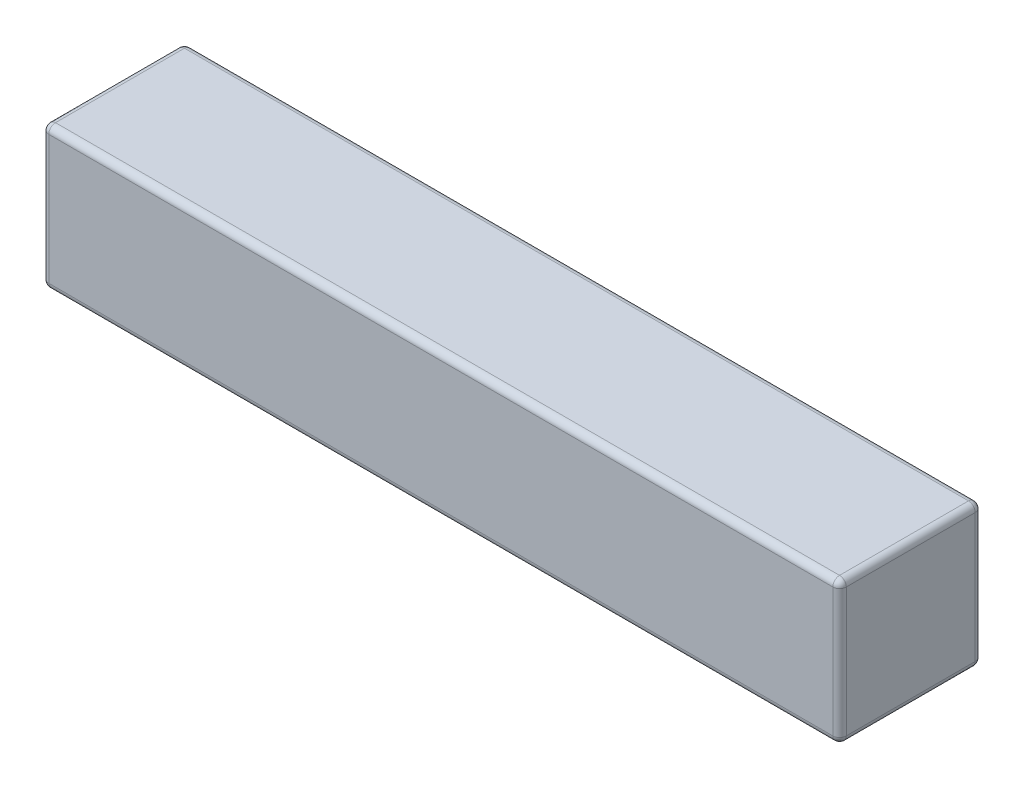
ISO-10303-21;
HEADER;
FILE_DESCRIPTION(('STEP AP214'),'2;1');
FILE_NAME('part.step','',(''),(''),'','','');
FILE_SCHEMA(('AUTOMOTIVE_DESIGN { 1 0 10303 214 1 1 1 1 }'));
ENDSEC;
DATA;
#1=APPLICATION_CONTEXT('core data for automotive mechanical design processes');
#2=APPLICATION_PROTOCOL_DEFINITION('international standard','automotive_design',2000,#1);
#3=PRODUCT_CONTEXT('',#1,'mechanical');
#4=PRODUCT('Part','Part','',(#3));
#5=PRODUCT_RELATED_PRODUCT_CATEGORY('part','',(#4));
#6=PRODUCT_DEFINITION_FORMATION('','',#4);
#7=PRODUCT_DEFINITION_CONTEXT('part definition',#1,'design');
#8=PRODUCT_DEFINITION('design','',#6,#7);
#9=PRODUCT_DEFINITION_SHAPE('','',#8);
#10=(LENGTH_UNIT() NAMED_UNIT(*) SI_UNIT(.MILLI.,.METRE.));
#11=(NAMED_UNIT(*) PLANE_ANGLE_UNIT() SI_UNIT($,.RADIAN.));
#12=(NAMED_UNIT(*) SI_UNIT($,.STERADIAN.) SOLID_ANGLE_UNIT());
#13=UNCERTAINTY_MEASURE_WITH_UNIT(LENGTH_MEASURE(1.E-05),#10,'distance_accuracy_value','');
#14=(GEOMETRIC_REPRESENTATION_CONTEXT(3) GLOBAL_UNCERTAINTY_ASSIGNED_CONTEXT((#13)) GLOBAL_UNIT_ASSIGNED_CONTEXT((#10,
#11,#12)) REPRESENTATION_CONTEXT('',''));
#15=CARTESIAN_POINT('',(0.,0.,0.));
#16=DIRECTION('',(0.,0.,1.));
#17=DIRECTION('',(1.,0.,0.));
#18=AXIS2_PLACEMENT_3D('',#15,#16,#17);
#19=CARTESIAN_POINT('',(13.85,-0.15,-0.379239631336402));
#20=DIRECTION('',(1.,0.,0.));
#21=DIRECTION('',(0.,0.,-1.));
#22=AXIS2_PLACEMENT_3D('',#19,#20,#21);
#23=SPHERICAL_SURFACE('',#22,0.15);
#24=CARTESIAN_POINT('',(13.85,-0.15,-0.379239631336402));
#25=DIRECTION('',(0.,1.,0.));
#26=DIRECTION('',(0.,0.,1.));
#27=AXIS2_PLACEMENT_3D('',#24,#25,#26);
#28=CIRCLE('',#27,0.15);
#29=CARTESIAN_POINT('',(14.,-0.15,-0.379239631336402));
#30=VERTEX_POINT('',#29);
#31=CARTESIAN_POINT('',(13.85,-0.15,-0.229239631336402));
#32=VERTEX_POINT('',#31);
#33=EDGE_CURVE('E293',#30,#32,#28,.F.);
#34=ORIENTED_EDGE('',*,*,#33,.F.);
#35=CARTESIAN_POINT('',(13.85,-0.15,-0.379239631336402));
#36=DIRECTION('',(0.,0.,-1.));
#37=DIRECTION('',(-1.,0.,0.));
#38=AXIS2_PLACEMENT_3D('',#35,#36,#37);
#39=CIRCLE('',#38,0.150000000000001);
#40=CARTESIAN_POINT('',(13.85,0.,-0.379239631336402));
#41=VERTEX_POINT('',#40);
#42=EDGE_CURVE('E115',#41,#30,#39,.T.);
#43=ORIENTED_EDGE('',*,*,#42,.F.);
#44=CARTESIAN_POINT('',(13.85,-0.15,-0.379239631336402));
#45=DIRECTION('',(1.,0.,0.));
#46=DIRECTION('',(0.,0.,-1.));
#47=AXIS2_PLACEMENT_3D('',#44,#45,#46);
#48=CIRCLE('',#47,0.15);
#49=EDGE_CURVE('E104',#32,#41,#48,.F.);
#50=ORIENTED_EDGE('',*,*,#49,.F.);
#51=EDGE_LOOP('',(#34,#43,#50));
#52=FACE_BOUND('',#51,.T.);
#53=ADVANCED_FACE('F17',(#52),#23,.T.);
#54=CARTESIAN_POINT('',(13.85,-0.15,-3.2542396313364));
#55=DIRECTION('',(1.,0.,0.));
#56=DIRECTION('',(0.,0.,-1.));
#57=AXIS2_PLACEMENT_3D('',#54,#55,#56);
#58=SPHERICAL_SURFACE('',#57,0.15);
#59=CARTESIAN_POINT('',(13.85,-0.15,-3.2542396313364));
#60=DIRECTION('',(0.,1.,0.));
#61=DIRECTION('',(0.,0.,1.));
#62=AXIS2_PLACEMENT_3D('',#59,#60,#61);
#63=CIRCLE('',#62,0.15);
#64=CARTESIAN_POINT('',(13.85,-0.15,-3.4042396313364));
#65=VERTEX_POINT('',#64);
#66=CARTESIAN_POINT('',(14.,-0.15,-3.2542396313364));
#67=VERTEX_POINT('',#66);
#68=EDGE_CURVE('E136',#65,#67,#63,.F.);
#69=ORIENTED_EDGE('',*,*,#68,.F.);
#70=CARTESIAN_POINT('',(13.85,-0.15,-3.2542396313364));
#71=DIRECTION('',(-1.,0.,0.));
#72=DIRECTION('',(0.,0.,1.));
#73=AXIS2_PLACEMENT_3D('',#70,#71,#72);
#74=CIRCLE('',#73,0.15);
#75=CARTESIAN_POINT('',(13.85,0.,-3.2542396313364));
#76=VERTEX_POINT('',#75);
#77=EDGE_CURVE('E288',#76,#65,#74,.T.);
#78=ORIENTED_EDGE('',*,*,#77,.F.);
#79=CARTESIAN_POINT('',(13.85,-0.15,-3.2542396313364));
#80=DIRECTION('',(0.,0.,-1.));
#81=DIRECTION('',(-1.,0.,0.));
#82=AXIS2_PLACEMENT_3D('',#79,#80,#81);
#83=CIRCLE('',#82,0.150000000000001);
#84=EDGE_CURVE('E284',#67,#76,#83,.F.);
#85=ORIENTED_EDGE('',*,*,#84,.F.);
#86=EDGE_LOOP('',(#69,#78,#85));
#87=FACE_BOUND('',#86,.T.);
#88=ADVANCED_FACE('F157',(#87),#58,.T.);
#89=CARTESIAN_POINT('',(-3.78,0.,-0.229239631336402));
#90=DIRECTION('',(0.,1.,0.));
#91=DIRECTION('',(0.,0.,1.));
#92=AXIS2_PLACEMENT_3D('',#89,#90,#91);
#93=PLANE('',#92);
#94=DIRECTION('',(0.,0.,1.));
#95=VECTOR('',#94,1.);
#96=CARTESIAN_POINT('',(-3.63,0.,-0.229239631336402));
#97=LINE('',#96,#95);
#98=CARTESIAN_POINT('',(-3.63,0.,-0.379239631336402));
#99=VERTEX_POINT('',#98);
#100=CARTESIAN_POINT('',(-3.63,0.,-3.2542396313364));
#101=VERTEX_POINT('',#100);
#102=EDGE_CURVE('E119',#99,#101,#97,.F.);
#103=ORIENTED_EDGE('',*,*,#102,.F.);
#104=DIRECTION('',(1.,0.,0.));
#105=VECTOR('',#104,1.);
#106=CARTESIAN_POINT('',(-3.78,0.,-0.379239631336402));
#107=LINE('',#106,#105);
#108=EDGE_CURVE('E107',#41,#99,#107,.F.);
#109=ORIENTED_EDGE('',*,*,#108,.F.);
#110=DIRECTION('',(0.,0.,-1.));
#111=VECTOR('',#110,1.);
#112=CARTESIAN_POINT('',(13.85,0.,-0.229239631336402));
#113=LINE('',#112,#111);
#114=EDGE_CURVE('E286',#76,#41,#113,.F.);
#115=ORIENTED_EDGE('',*,*,#114,.F.);
#116=DIRECTION('',(-1.,0.,0.));
#117=VECTOR('',#116,1.);
#118=CARTESIAN_POINT('',(-3.78,0.,-3.2542396313364));
#119=LINE('',#118,#117);
#120=EDGE_CURVE('E123',#101,#76,#119,.F.);
#121=ORIENTED_EDGE('',*,*,#120,.F.);
#122=EDGE_LOOP('',(#103,#109,#115,#121));
#123=FACE_BOUND('',#122,.T.);
#124=ADVANCED_FACE('F121',(#123),#93,.T.);
#125=CARTESIAN_POINT('',(-3.63,-0.15,-3.2542396313364));
#126=DIRECTION('',(1.,0.,0.));
#127=DIRECTION('',(0.,0.,-1.));
#128=AXIS2_PLACEMENT_3D('',#125,#126,#127);
#129=SPHERICAL_SURFACE('',#128,0.15);
#130=CARTESIAN_POINT('',(-3.63,-0.15,-3.2542396313364));
#131=DIRECTION('',(0.,0.,1.));
#132=DIRECTION('',(1.,0.,0.));
#133=AXIS2_PLACEMENT_3D('',#130,#131,#132);
#134=CIRCLE('',#133,0.15);
#135=CARTESIAN_POINT('',(-3.78,-0.15,-3.2542396313364));
#136=VERTEX_POINT('',#135);
#137=EDGE_CURVE('E125',#101,#136,#134,.T.);
#138=ORIENTED_EDGE('',*,*,#137,.F.);
#139=CARTESIAN_POINT('',(-3.63,-0.15,-3.2542396313364));
#140=DIRECTION('',(-1.,0.,0.));
#141=DIRECTION('',(0.,0.,1.));
#142=AXIS2_PLACEMENT_3D('',#139,#140,#141);
#143=CIRCLE('',#142,0.15);
#144=CARTESIAN_POINT('',(-3.63,-0.15,-3.4042396313364));
#145=VERTEX_POINT('',#144);
#146=EDGE_CURVE('E292',#145,#101,#143,.F.);
#147=ORIENTED_EDGE('',*,*,#146,.F.);
#148=CARTESIAN_POINT('',(-3.63,-0.15,-3.2542396313364));
#149=DIRECTION('',(0.,1.,0.));
#150=DIRECTION('',(0.,0.,1.));
#151=AXIS2_PLACEMENT_3D('',#148,#149,#150);
#152=CIRCLE('',#151,0.15);
#153=EDGE_CURVE('E365',#136,#145,#152,.F.);
#154=ORIENTED_EDGE('',*,*,#153,.F.);
#155=EDGE_LOOP('',(#138,#147,#154));
#156=FACE_BOUND('',#155,.T.);
#157=ADVANCED_FACE('F151',(#156),#129,.T.);
#158=CARTESIAN_POINT('',(-3.63,-0.15,-0.379239631336402));
#159=DIRECTION('',(1.,0.,0.));
#160=DIRECTION('',(0.,0.,-1.));
#161=AXIS2_PLACEMENT_3D('',#158,#159,#160);
#162=SPHERICAL_SURFACE('',#161,0.15);
#163=CARTESIAN_POINT('',(-3.63,-0.15,-0.379239631336402));
#164=DIRECTION('',(1.,0.,0.));
#165=DIRECTION('',(0.,0.,-1.));
#166=AXIS2_PLACEMENT_3D('',#163,#164,#165);
#167=CIRCLE('',#166,0.15);
#168=CARTESIAN_POINT('',(-3.63,-0.15,-0.229239631336402));
#169=VERTEX_POINT('',#168);
#170=EDGE_CURVE('E111',#99,#169,#167,.T.);
#171=ORIENTED_EDGE('',*,*,#170,.F.);
#172=CARTESIAN_POINT('',(-3.63,-0.15,-0.379239631336402));
#173=DIRECTION('',(0.,0.,1.));
#174=DIRECTION('',(1.,0.,0.));
#175=AXIS2_PLACEMENT_3D('',#172,#173,#174);
#176=CIRCLE('',#175,0.15);
#177=CARTESIAN_POINT('',(-3.78,-0.15,-0.379239631336402));
#178=VERTEX_POINT('',#177);
#179=EDGE_CURVE('E126',#178,#99,#176,.F.);
#180=ORIENTED_EDGE('',*,*,#179,.F.);
#181=CARTESIAN_POINT('',(-3.63,-0.15,-0.379239631336402));
#182=DIRECTION('',(0.,1.,0.));
#183=DIRECTION('',(0.,0.,1.));
#184=AXIS2_PLACEMENT_3D('',#181,#182,#183);
#185=CIRCLE('',#184,0.15);
#186=EDGE_CURVE('E139',#169,#178,#185,.F.);
#187=ORIENTED_EDGE('',*,*,#186,.F.);
#188=EDGE_LOOP('',(#171,#180,#187));
#189=FACE_BOUND('',#188,.T.);
#190=ADVANCED_FACE('F138',(#189),#162,.T.);
#191=CARTESIAN_POINT('',(-3.78,-0.15,-0.379239631336402));
#192=DIRECTION('',(1.,0.,0.));
#193=DIRECTION('',(0.,0.,-1.));
#194=AXIS2_PLACEMENT_3D('',#191,#192,#193);
#195=CYLINDRICAL_SURFACE('',#194,0.15);
#196=ORIENTED_EDGE('',*,*,#49,.T.);
#197=ORIENTED_EDGE('',*,*,#108,.T.);
#198=ORIENTED_EDGE('',*,*,#170,.T.);
#199=DIRECTION('',(1.,0.,0.));
#200=VECTOR('',#199,1.);
#201=CARTESIAN_POINT('',(-3.78,-0.15,-0.229239631336402));
#202=LINE('',#201,#200);
#203=EDGE_CURVE('E378',#32,#169,#202,.F.);
#204=ORIENTED_EDGE('',*,*,#203,.F.);
#205=EDGE_LOOP('',(#196,#197,#198,#204));
#206=FACE_BOUND('',#205,.T.);
#207=ADVANCED_FACE('F109',(#206),#195,.T.);
#208=CARTESIAN_POINT('',(13.85,-0.15,-0.229239631336402));
#209=DIRECTION('',(0.,0.,-1.));
#210=DIRECTION('',(-1.,0.,0.));
#211=AXIS2_PLACEMENT_3D('',#208,#209,#210);
#212=CYLINDRICAL_SURFACE('',#211,0.150000000000001);
#213=ORIENTED_EDGE('',*,*,#84,.T.);
#214=ORIENTED_EDGE('',*,*,#114,.T.);
#215=ORIENTED_EDGE('',*,*,#42,.T.);
#216=DIRECTION('',(0.,0.,-1.));
#217=VECTOR('',#216,1.);
#218=CARTESIAN_POINT('',(14.,-0.15,-0.229239631336402));
#219=LINE('',#218,#217);
#220=EDGE_CURVE('E236',#67,#30,#219,.F.);
#221=ORIENTED_EDGE('',*,*,#220,.F.);
#222=EDGE_LOOP('',(#213,#214,#215,#221));
#223=FACE_BOUND('',#222,.T.);
#224=ADVANCED_FACE('F274',(#223),#212,.T.);
#225=CARTESIAN_POINT('',(13.85,-3.175,-0.379239631336402));
#226=DIRECTION('',(0.,1.,0.));
#227=DIRECTION('',(0.,0.,1.));
#228=AXIS2_PLACEMENT_3D('',#225,#226,#227);
#229=CYLINDRICAL_SURFACE('',#228,0.15);
#230=ORIENTED_EDGE('',*,*,#33,.T.);
#231=DIRECTION('',(0.,1.,0.));
#232=VECTOR('',#231,1.);
#233=CARTESIAN_POINT('',(13.85,-3.175,-0.229239631336402));
#234=LINE('',#233,#232);
#235=CARTESIAN_POINT('',(13.85,-3.02499999999923,-0.229239631336402));
#236=VERTEX_POINT('',#235);
#237=EDGE_CURVE('E310',#236,#32,#234,.T.);
#238=ORIENTED_EDGE('',*,*,#237,.F.);
#239=CARTESIAN_POINT('',(13.85,-3.025,-0.379239631336402));
#240=DIRECTION('',(0.,-1.,2.04433251509177E-11));
#241=DIRECTION('',(1.,0.,0.));
#242=AXIS2_PLACEMENT_3D('',#239,#240,#241);
#243=CIRCLE('',#242,0.15);
#244=CARTESIAN_POINT('',(14.,-3.025,-0.379239631336402));
#245=VERTEX_POINT('',#244);
#246=EDGE_CURVE('E242',#245,#236,#243,.T.);
#247=ORIENTED_EDGE('',*,*,#246,.F.);
#248=DIRECTION('',(0.,1.,0.));
#249=VECTOR('',#248,1.);
#250=CARTESIAN_POINT('',(14.,-3.175,-0.379239631336402));
#251=LINE('',#250,#249);
#252=EDGE_CURVE('E234',#30,#245,#251,.F.);
#253=ORIENTED_EDGE('',*,*,#252,.F.);
#254=EDGE_LOOP('',(#230,#238,#247,#253));
#255=FACE_BOUND('',#254,.T.);
#256=ADVANCED_FACE('F271',(#255),#229,.T.);
#257=CARTESIAN_POINT('',(-3.78,-0.15,-3.2542396313364));
#258=DIRECTION('',(-1.,0.,0.));
#259=DIRECTION('',(0.,0.,1.));
#260=AXIS2_PLACEMENT_3D('',#257,#258,#259);
#261=CYLINDRICAL_SURFACE('',#260,0.15);
#262=ORIENTED_EDGE('',*,*,#146,.T.);
#263=ORIENTED_EDGE('',*,*,#120,.T.);
#264=ORIENTED_EDGE('',*,*,#77,.T.);
#265=DIRECTION('',(-1.,0.,0.));
#266=VECTOR('',#265,1.);
#267=CARTESIAN_POINT('',(14.,-0.15,-3.4042396313364));
#268=LINE('',#267,#266);
#269=EDGE_CURVE('E375',#145,#65,#268,.F.);
#270=ORIENTED_EDGE('',*,*,#269,.F.);
#271=EDGE_LOOP('',(#262,#263,#264,#270));
#272=FACE_BOUND('',#271,.T.);
#273=ADVANCED_FACE('F267',(#272),#261,.T.);
#274=CARTESIAN_POINT('',(13.85,-3.175,-3.2542396313364));
#275=DIRECTION('',(0.,1.,0.));
#276=DIRECTION('',(0.,0.,1.));
#277=AXIS2_PLACEMENT_3D('',#274,#275,#276);
#278=CYLINDRICAL_SURFACE('',#277,0.15);
#279=ORIENTED_EDGE('',*,*,#68,.T.);
#280=DIRECTION('',(0.,1.,0.));
#281=VECTOR('',#280,1.);
#282=CARTESIAN_POINT('',(14.,-3.175,-3.2542396313364));
#283=LINE('',#282,#281);
#284=CARTESIAN_POINT('',(14.,-3.025,-3.2542396313364));
#285=VERTEX_POINT('',#284);
#286=EDGE_CURVE('E239',#285,#67,#283,.T.);
#287=ORIENTED_EDGE('',*,*,#286,.F.);
#288=CARTESIAN_POINT('',(13.85,-3.025,-3.2542396313364));
#289=DIRECTION('',(0.,1.,0.));
#290=DIRECTION('',(1.,0.,0.));
#291=AXIS2_PLACEMENT_3D('',#288,#289,#290);
#292=CIRCLE('',#291,0.15);
#293=CARTESIAN_POINT('',(13.85,-3.025,-3.4042396313364));
#294=VERTEX_POINT('',#293);
#295=EDGE_CURVE('E232',#294,#285,#292,.F.);
#296=ORIENTED_EDGE('',*,*,#295,.F.);
#297=DIRECTION('',(0.,1.,0.));
#298=VECTOR('',#297,1.);
#299=CARTESIAN_POINT('',(13.85,-3.175,-3.4042396313364));
#300=LINE('',#299,#298);
#301=EDGE_CURVE('E374',#65,#294,#300,.F.);
#302=ORIENTED_EDGE('',*,*,#301,.F.);
#303=EDGE_LOOP('',(#279,#287,#296,#302));
#304=FACE_BOUND('',#303,.T.);
#305=ADVANCED_FACE('F264',(#304),#278,.T.);
#306=CARTESIAN_POINT('',(-3.63,-0.15,-0.229239631336402));
#307=DIRECTION('',(0.,0.,1.));
#308=DIRECTION('',(1.,0.,0.));
#309=AXIS2_PLACEMENT_3D('',#306,#307,#308);
#310=CYLINDRICAL_SURFACE('',#309,0.15);
#311=ORIENTED_EDGE('',*,*,#137,.T.);
#312=DIRECTION('',(0.,0.,1.));
#313=VECTOR('',#312,1.);
#314=CARTESIAN_POINT('',(-3.78,-0.15,-3.4042396313364));
#315=LINE('',#314,#313);
#316=EDGE_CURVE('E132',#178,#136,#315,.F.);
#317=ORIENTED_EDGE('',*,*,#316,.F.);
#318=ORIENTED_EDGE('',*,*,#179,.T.);
#319=ORIENTED_EDGE('',*,*,#102,.T.);
#320=EDGE_LOOP('',(#311,#317,#318,#319));
#321=FACE_BOUND('',#320,.T.);
#322=ADVANCED_FACE('F130',(#321),#310,.T.);
#323=CARTESIAN_POINT('',(-3.63,-3.175,-3.2542396313364));
#324=DIRECTION('',(0.,1.,0.));
#325=DIRECTION('',(0.,0.,1.));
#326=AXIS2_PLACEMENT_3D('',#323,#324,#325);
#327=CYLINDRICAL_SURFACE('',#326,0.15);
#328=ORIENTED_EDGE('',*,*,#153,.T.);
#329=DIRECTION('',(0.,1.,0.));
#330=VECTOR('',#329,1.);
#331=CARTESIAN_POINT('',(-3.63,-3.175,-3.4042396313364));
#332=LINE('',#331,#330);
#333=CARTESIAN_POINT('',(-3.63,-3.025,-3.4042396313364));
#334=VERTEX_POINT('',#333);
#335=EDGE_CURVE('E230',#334,#145,#332,.T.);
#336=ORIENTED_EDGE('',*,*,#335,.F.);
#337=CARTESIAN_POINT('',(-3.63,-3.025,-3.2542396313364));
#338=DIRECTION('',(0.,1.,0.));
#339=DIRECTION('',(0.,0.,1.));
#340=AXIS2_PLACEMENT_3D('',#337,#338,#339);
#341=CIRCLE('',#340,0.15);
#342=CARTESIAN_POINT('',(-3.78,-3.025,-3.2542396313364));
#343=VERTEX_POINT('',#342);
#344=EDGE_CURVE('E367',#334,#343,#341,.T.);
#345=ORIENTED_EDGE('',*,*,#344,.T.);
#346=DIRECTION('',(0.,1.,0.));
#347=VECTOR('',#346,1.);
#348=CARTESIAN_POINT('',(-3.78,-3.175,-3.2542396313364));
#349=LINE('',#348,#347);
#350=EDGE_CURVE('E204',#136,#343,#349,.F.);
#351=ORIENTED_EDGE('',*,*,#350,.F.);
#352=EDGE_LOOP('',(#328,#336,#345,#351));
#353=FACE_BOUND('',#352,.T.);
#354=ADVANCED_FACE('F257',(#353),#327,.T.);
#355=CARTESIAN_POINT('',(-3.63,-3.175,-0.379239631336402));
#356=DIRECTION('',(0.,1.,0.));
#357=DIRECTION('',(0.,0.,1.));
#358=AXIS2_PLACEMENT_3D('',#355,#356,#357);
#359=CYLINDRICAL_SURFACE('',#358,0.15);
#360=ORIENTED_EDGE('',*,*,#186,.T.);
#361=DIRECTION('',(0.,1.,0.));
#362=VECTOR('',#361,1.);
#363=CARTESIAN_POINT('',(-3.78,-3.175,-0.379239631336402));
#364=LINE('',#363,#362);
#365=CARTESIAN_POINT('',(-3.78,-3.025,-0.379239631336402));
#366=VERTEX_POINT('',#365);
#367=EDGE_CURVE('E202',#366,#178,#364,.T.);
#368=ORIENTED_EDGE('',*,*,#367,.F.);
#369=CARTESIAN_POINT('',(-3.63,-3.025,-0.379239631336402));
#370=DIRECTION('',(0.,-1.,0.));
#371=DIRECTION('',(1.,0.,0.));
#372=AXIS2_PLACEMENT_3D('',#369,#370,#371);
#373=CIRCLE('',#372,0.15);
#374=CARTESIAN_POINT('',(-3.63,-3.025,-0.229239631336402));
#375=VERTEX_POINT('',#374);
#376=EDGE_CURVE('E208',#375,#366,#373,.T.);
#377=ORIENTED_EDGE('',*,*,#376,.F.);
#378=DIRECTION('',(0.,1.,0.));
#379=VECTOR('',#378,1.);
#380=CARTESIAN_POINT('',(-3.63,-3.175,-0.229239631336402));
#381=LINE('',#380,#379);
#382=EDGE_CURVE('E315',#169,#375,#381,.F.);
#383=ORIENTED_EDGE('',*,*,#382,.F.);
#384=EDGE_LOOP('',(#360,#368,#377,#383));
#385=FACE_BOUND('',#384,.T.);
#386=ADVANCED_FACE('F253',(#385),#359,.T.);
#387=CARTESIAN_POINT('',(-3.78,-3.175,-0.229239631336402));
#388=DIRECTION('',(0.,0.,1.));
#389=DIRECTION('',(1.,0.,0.));
#390=AXIS2_PLACEMENT_3D('',#387,#388,#389);
#391=PLANE('',#390);
#392=ORIENTED_EDGE('',*,*,#382,.T.);
#393=DIRECTION('',(-1.,0.,0.));
#394=VECTOR('',#393,1.);
#395=CARTESIAN_POINT('',(-3.78,-3.025,-0.229239631336402));
#396=LINE('',#395,#394);
#397=EDGE_CURVE('E328',#236,#375,#396,.T.);
#398=ORIENTED_EDGE('',*,*,#397,.F.);
#399=ORIENTED_EDGE('',*,*,#237,.T.);
#400=ORIENTED_EDGE('',*,*,#203,.T.);
#401=EDGE_LOOP('',(#392,#398,#399,#400));
#402=FACE_BOUND('',#401,.T.);
#403=ADVANCED_FACE('F249',(#402),#391,.T.);
#404=CARTESIAN_POINT('',(13.85,-3.025,-0.379239631336402));
#405=DIRECTION('',(1.,0.,0.));
#406=DIRECTION('',(0.,0.,-1.));
#407=AXIS2_PLACEMENT_3D('',#404,#405,#406);
#408=SPHERICAL_SURFACE('',#407,0.15);
#409=CARTESIAN_POINT('',(13.85,-3.025,-0.379239631336402));
#410=DIRECTION('',(-1.,0.,0.));
#411=DIRECTION('',(0.,0.,1.));
#412=AXIS2_PLACEMENT_3D('',#409,#410,#411);
#413=CIRCLE('',#412,0.15);
#414=CARTESIAN_POINT('',(13.85,-3.175,-0.379239631336402));
#415=VERTEX_POINT('',#414);
#416=EDGE_CURVE('E200',#415,#236,#413,.T.);
#417=ORIENTED_EDGE('',*,*,#416,.F.);
#418=CARTESIAN_POINT('',(13.85,-3.025,-0.379239631336402));
#419=DIRECTION('',(0.,0.,1.));
#420=DIRECTION('',(1.,0.,0.));
#421=AXIS2_PLACEMENT_3D('',#418,#419,#420);
#422=CIRCLE('',#421,0.150000000000001);
#423=EDGE_CURVE('E319',#245,#415,#422,.F.);
#424=ORIENTED_EDGE('',*,*,#423,.F.);
#425=ORIENTED_EDGE('',*,*,#246,.T.);
#426=EDGE_LOOP('',(#417,#424,#425));
#427=FACE_BOUND('',#426,.T.);
#428=ADVANCED_FACE('F246',(#427),#408,.T.);
#429=CARTESIAN_POINT('',(14.,-3.175,-0.229239631336402));
#430=DIRECTION('',(1.,0.,0.));
#431=DIRECTION('',(0.,0.,-1.));
#432=AXIS2_PLACEMENT_3D('',#429,#430,#431);
#433=PLANE('',#432);
#434=ORIENTED_EDGE('',*,*,#220,.T.);
#435=ORIENTED_EDGE('',*,*,#252,.T.);
#436=DIRECTION('',(0.,0.,1.));
#437=VECTOR('',#436,1.);
#438=CARTESIAN_POINT('',(14.,-3.025,-0.229239631336402));
#439=LINE('',#438,#437);
#440=EDGE_CURVE('E317',#285,#245,#439,.T.);
#441=ORIENTED_EDGE('',*,*,#440,.F.);
#442=ORIENTED_EDGE('',*,*,#286,.T.);
#443=EDGE_LOOP('',(#434,#435,#441,#442));
#444=FACE_BOUND('',#443,.T.);
#445=ADVANCED_FACE('F224',(#444),#433,.T.);
#446=CARTESIAN_POINT('',(13.85,-3.025,-3.2542396313364));
#447=DIRECTION('',(1.,0.,0.));
#448=DIRECTION('',(0.,0.,-1.));
#449=AXIS2_PLACEMENT_3D('',#446,#447,#448);
#450=SPHERICAL_SURFACE('',#449,0.15);
#451=CARTESIAN_POINT('',(13.85,-3.025,-3.2542396313364));
#452=DIRECTION('',(1.,0.,0.));
#453=DIRECTION('',(0.,0.,-1.));
#454=AXIS2_PLACEMENT_3D('',#451,#452,#453);
#455=CIRCLE('',#454,0.15);
#456=CARTESIAN_POINT('',(13.85,-3.175,-3.25423963133334));
#457=VERTEX_POINT('',#456);
#458=EDGE_CURVE('E322',#294,#457,#455,.F.);
#459=ORIENTED_EDGE('',*,*,#458,.F.);
#460=ORIENTED_EDGE('',*,*,#295,.T.);
#461=CARTESIAN_POINT('',(13.85,-3.025,-3.2542396313364));
#462=DIRECTION('',(0.,0.,1.));
#463=DIRECTION('',(1.,0.,0.));
#464=AXIS2_PLACEMENT_3D('',#461,#462,#463);
#465=CIRCLE('',#464,0.150000000000001);
#466=EDGE_CURVE('E321',#457,#285,#465,.T.);
#467=ORIENTED_EDGE('',*,*,#466,.F.);
#468=EDGE_LOOP('',(#459,#460,#467));
#469=FACE_BOUND('',#468,.T.);
#470=ADVANCED_FACE('F219',(#469),#450,.T.);
#471=CARTESIAN_POINT('',(14.,-3.175,-3.4042396313364));
#472=DIRECTION('',(0.,0.,-1.));
#473=DIRECTION('',(-1.,0.,0.));
#474=AXIS2_PLACEMENT_3D('',#471,#472,#473);
#475=PLANE('',#474);
#476=ORIENTED_EDGE('',*,*,#301,.T.);
#477=DIRECTION('',(1.,0.,0.));
#478=VECTOR('',#477,1.);
#479=CARTESIAN_POINT('',(14.,-3.025,-3.4042396313364));
#480=LINE('',#479,#478);
#481=EDGE_CURVE('E349',#334,#294,#480,.T.);
#482=ORIENTED_EDGE('',*,*,#481,.F.);
#483=ORIENTED_EDGE('',*,*,#335,.T.);
#484=ORIENTED_EDGE('',*,*,#269,.T.);
#485=EDGE_LOOP('',(#476,#482,#483,#484));
#486=FACE_BOUND('',#485,.T.);
#487=ADVANCED_FACE('F215',(#486),#475,.T.);
#488=CARTESIAN_POINT('',(-3.63,-3.025,-0.379239631336402));
#489=DIRECTION('',(1.,0.,0.));
#490=DIRECTION('',(0.,0.,-1.));
#491=AXIS2_PLACEMENT_3D('',#488,#489,#490);
#492=SPHERICAL_SURFACE('',#491,0.15);
#493=CARTESIAN_POINT('',(-3.63,-3.025,-0.379239631336402));
#494=DIRECTION('',(-1.,0.,0.));
#495=DIRECTION('',(0.,0.,1.));
#496=AXIS2_PLACEMENT_3D('',#493,#494,#495);
#497=CIRCLE('',#496,0.15);
#498=CARTESIAN_POINT('',(-3.63,-3.175,-0.37923963133621));
#499=VERTEX_POINT('',#498);
#500=EDGE_CURVE('E325',#375,#499,#497,.F.);
#501=ORIENTED_EDGE('',*,*,#500,.F.);
#502=ORIENTED_EDGE('',*,*,#376,.T.);
#503=CARTESIAN_POINT('',(-3.63,-3.025,-0.379239631336402));
#504=DIRECTION('',(0.,0.,-1.));
#505=DIRECTION('',(-1.,0.,0.));
#506=AXIS2_PLACEMENT_3D('',#503,#504,#505);
#507=CIRCLE('',#506,0.15);
#508=EDGE_CURVE('E346',#499,#366,#507,.T.);
#509=ORIENTED_EDGE('',*,*,#508,.F.);
#510=EDGE_LOOP('',(#501,#502,#509));
#511=FACE_BOUND('',#510,.T.);
#512=ADVANCED_FACE('F212',(#511),#492,.T.);
#513=CARTESIAN_POINT('',(-3.78,-3.175,-3.4042396313364));
#514=DIRECTION('',(-1.,0.,0.));
#515=DIRECTION('',(0.,0.,1.));
#516=AXIS2_PLACEMENT_3D('',#513,#514,#515);
#517=PLANE('',#516);
#518=DIRECTION('',(0.,0.,-1.));
#519=VECTOR('',#518,1.);
#520=CARTESIAN_POINT('',(-3.78,-3.025,-3.4042396313364));
#521=LINE('',#520,#519);
#522=EDGE_CURVE('E341',#366,#343,#521,.T.);
#523=ORIENTED_EDGE('',*,*,#522,.F.);
#524=ORIENTED_EDGE('',*,*,#367,.T.);
#525=ORIENTED_EDGE('',*,*,#316,.T.);
#526=ORIENTED_EDGE('',*,*,#350,.T.);
#527=EDGE_LOOP('',(#523,#524,#525,#526));
#528=FACE_BOUND('',#527,.T.);
#529=ADVANCED_FACE('F194',(#528),#517,.T.);
#530=CARTESIAN_POINT('',(-3.63,-3.025,-3.2542396313364));
#531=DIRECTION('',(1.,0.,0.));
#532=DIRECTION('',(0.,0.,-1.));
#533=AXIS2_PLACEMENT_3D('',#530,#531,#532);
#534=SPHERICAL_SURFACE('',#533,0.15);
#535=CARTESIAN_POINT('',(-3.63,-3.025,-3.2542396313364));
#536=DIRECTION('',(0.,0.,-1.));
#537=DIRECTION('',(-1.,0.,0.));
#538=AXIS2_PLACEMENT_3D('',#535,#536,#537);
#539=CIRCLE('',#538,0.15);
#540=CARTESIAN_POINT('',(-3.63,-3.175,-3.2542396313364));
#541=VERTEX_POINT('',#540);
#542=EDGE_CURVE('E34',#343,#541,#539,.F.);
#543=ORIENTED_EDGE('',*,*,#542,.F.);
#544=ORIENTED_EDGE('',*,*,#344,.F.);
#545=CARTESIAN_POINT('',(-3.63,-3.025,-3.2542396313364));
#546=DIRECTION('',(1.,0.,0.));
#547=DIRECTION('',(0.,0.,-1.));
#548=AXIS2_PLACEMENT_3D('',#545,#546,#547);
#549=CIRCLE('',#548,0.15);
#550=EDGE_CURVE('E352',#541,#334,#549,.T.);
#551=ORIENTED_EDGE('',*,*,#550,.F.);
#552=EDGE_LOOP('',(#543,#544,#551));
#553=FACE_BOUND('',#552,.T.);
#554=ADVANCED_FACE('F189',(#553),#534,.T.);
#555=CARTESIAN_POINT('',(-3.78,-3.025,-0.379239631336402));
#556=DIRECTION('',(-1.,0.,0.));
#557=DIRECTION('',(0.,0.,1.));
#558=AXIS2_PLACEMENT_3D('',#555,#556,#557);
#559=CYLINDRICAL_SURFACE('',#558,0.15);
#560=ORIENTED_EDGE('',*,*,#500,.T.);
#561=DIRECTION('',(1.,0.,0.));
#562=VECTOR('',#561,1.);
#563=CARTESIAN_POINT('',(-3.78,-3.175,-0.379239631336402));
#564=LINE('',#563,#562);
#565=EDGE_CURVE('E334',#499,#415,#564,.T.);
#566=ORIENTED_EDGE('',*,*,#565,.T.);
#567=ORIENTED_EDGE('',*,*,#416,.T.);
#568=ORIENTED_EDGE('',*,*,#397,.T.);
#569=EDGE_LOOP('',(#560,#566,#567,#568));
#570=FACE_BOUND('',#569,.T.);
#571=ADVANCED_FACE('F185',(#570),#559,.T.);
#572=CARTESIAN_POINT('',(13.85,-3.025,-0.229239631336402));
#573=DIRECTION('',(0.,0.,1.));
#574=DIRECTION('',(1.,0.,0.));
#575=AXIS2_PLACEMENT_3D('',#572,#573,#574);
#576=CYLINDRICAL_SURFACE('',#575,0.150000000000001);
#577=ORIENTED_EDGE('',*,*,#466,.T.);
#578=ORIENTED_EDGE('',*,*,#440,.T.);
#579=ORIENTED_EDGE('',*,*,#423,.T.);
#580=DIRECTION('',(0.,0.,1.));
#581=VECTOR('',#580,1.);
#582=CARTESIAN_POINT('',(13.85,-3.175,-0.229239631336402));
#583=LINE('',#582,#581);
#584=EDGE_CURVE('E338',#415,#457,#583,.F.);
#585=ORIENTED_EDGE('',*,*,#584,.T.);
#586=EDGE_LOOP('',(#577,#578,#579,#585));
#587=FACE_BOUND('',#586,.T.);
#588=ADVANCED_FACE('F181',(#587),#576,.T.);
#589=CARTESIAN_POINT('',(14.,-3.025,-3.2542396313364));
#590=DIRECTION('',(1.,0.,0.));
#591=DIRECTION('',(0.,0.,-1.));
#592=AXIS2_PLACEMENT_3D('',#589,#590,#591);
#593=CYLINDRICAL_SURFACE('',#592,0.15);
#594=ORIENTED_EDGE('',*,*,#550,.T.);
#595=ORIENTED_EDGE('',*,*,#481,.T.);
#596=ORIENTED_EDGE('',*,*,#458,.T.);
#597=DIRECTION('',(1.,0.,0.));
#598=VECTOR('',#597,1.);
#599=CARTESIAN_POINT('',(-3.78,-3.175,-3.2542396313364));
#600=LINE('',#599,#598);
#601=EDGE_CURVE('E26',#457,#541,#600,.F.);
#602=ORIENTED_EDGE('',*,*,#601,.T.);
#603=EDGE_LOOP('',(#594,#595,#596,#602));
#604=FACE_BOUND('',#603,.T.);
#605=ADVANCED_FACE('F175',(#604),#593,.T.);
#606=CARTESIAN_POINT('',(-3.63,-3.025,-3.4042396313364));
#607=DIRECTION('',(0.,0.,-1.));
#608=DIRECTION('',(-1.,0.,0.));
#609=AXIS2_PLACEMENT_3D('',#606,#607,#608);
#610=CYLINDRICAL_SURFACE('',#609,0.15);
#611=ORIENTED_EDGE('',*,*,#542,.T.);
#612=DIRECTION('',(0.,0.,1.));
#613=VECTOR('',#612,1.);
#614=CARTESIAN_POINT('',(-3.63,-3.175,-0.229239631336402));
#615=LINE('',#614,#613);
#616=EDGE_CURVE('E11',#541,#499,#615,.T.);
#617=ORIENTED_EDGE('',*,*,#616,.T.);
#618=ORIENTED_EDGE('',*,*,#508,.T.);
#619=ORIENTED_EDGE('',*,*,#522,.T.);
#620=EDGE_LOOP('',(#611,#617,#618,#619));
#621=FACE_BOUND('',#620,.T.);
#622=ADVANCED_FACE('F169',(#621),#610,.T.);
#623=CARTESIAN_POINT('',(-3.78,-3.175,-0.229239631336402));
#624=DIRECTION('',(0.,1.,0.));
#625=DIRECTION('',(0.,0.,1.));
#626=AXIS2_PLACEMENT_3D('',#623,#624,#625);
#627=PLANE('',#626);
#628=ORIENTED_EDGE('',*,*,#601,.F.);
#629=ORIENTED_EDGE('',*,*,#584,.F.);
#630=ORIENTED_EDGE('',*,*,#565,.F.);
#631=ORIENTED_EDGE('',*,*,#616,.F.);
#632=EDGE_LOOP('',(#628,#629,#630,#631));
#633=FACE_BOUND('',#632,.T.);
#634=ADVANCED_FACE('F167',(#633),#627,.F.);
#635=CLOSED_SHELL('',(#53,#88,#124,#157,#190,#207,#224,#256,#273,#305,#322,#354,#386,#403,#428,
#445,#470,#487,#512,#529,#554,#571,#588,#605,#622,#634));
#636=MANIFOLD_SOLID_BREP('B1',#635);
#637=ADVANCED_BREP_SHAPE_REPRESENTATION('',(#18,#636),#14);
#638=SHAPE_DEFINITION_REPRESENTATION(#9,#637);
ENDSEC;
END-ISO-10303-21;
